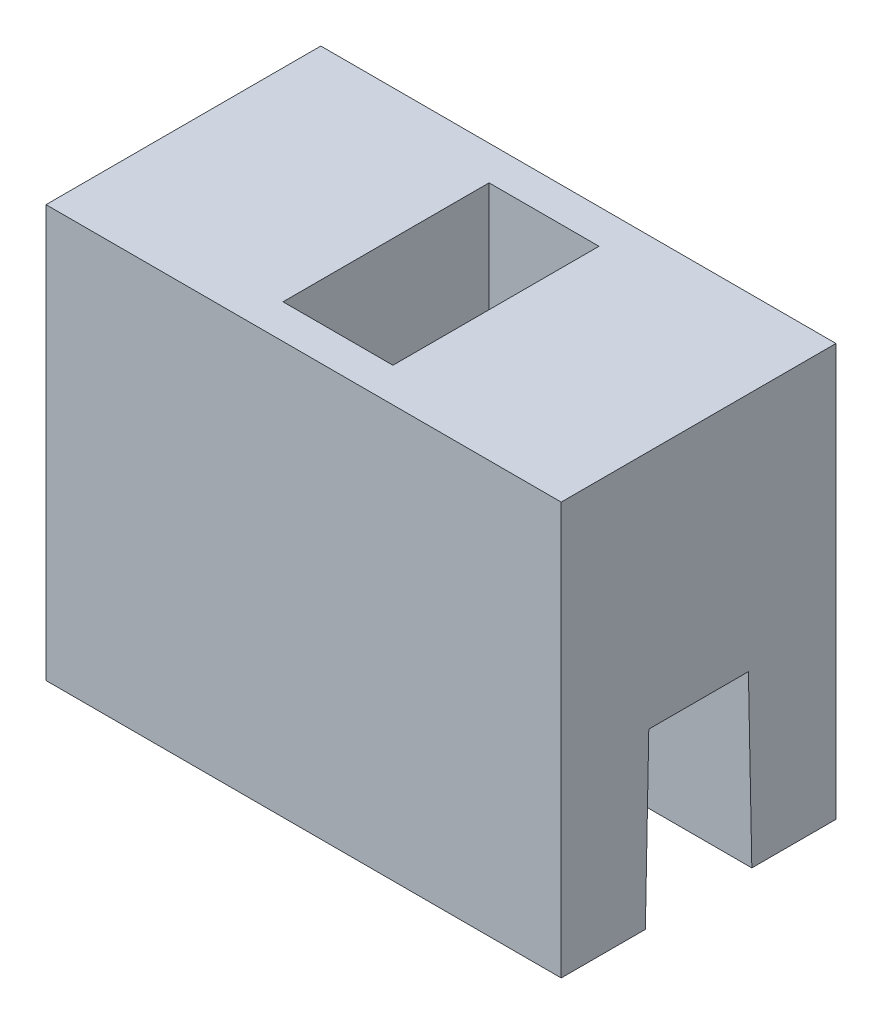
ISO-10303-21;
HEADER;
FILE_DESCRIPTION(('STEP AP214'),'2;1');
FILE_NAME('part.step','',(''),(''),'','','');
FILE_SCHEMA(('AUTOMOTIVE_DESIGN { 1 0 10303 214 1 1 1 1 }'));
ENDSEC;
DATA;
#1=APPLICATION_CONTEXT('core data for automotive mechanical design processes');
#2=APPLICATION_PROTOCOL_DEFINITION('international standard','automotive_design',2000,#1);
#3=PRODUCT_CONTEXT('',#1,'mechanical');
#4=PRODUCT('Part','Part','',(#3));
#5=PRODUCT_RELATED_PRODUCT_CATEGORY('part','',(#4));
#6=PRODUCT_DEFINITION_FORMATION('','',#4);
#7=PRODUCT_DEFINITION_CONTEXT('part definition',#1,'design');
#8=PRODUCT_DEFINITION('design','',#6,#7);
#9=PRODUCT_DEFINITION_SHAPE('','',#8);
#10=(LENGTH_UNIT() NAMED_UNIT(*) SI_UNIT(.MILLI.,.METRE.));
#11=(NAMED_UNIT(*) PLANE_ANGLE_UNIT() SI_UNIT($,.RADIAN.));
#12=(NAMED_UNIT(*) SI_UNIT($,.STERADIAN.) SOLID_ANGLE_UNIT());
#13=UNCERTAINTY_MEASURE_WITH_UNIT(LENGTH_MEASURE(1.E-05),#10,'distance_accuracy_value','');
#14=(GEOMETRIC_REPRESENTATION_CONTEXT(3) GLOBAL_UNCERTAINTY_ASSIGNED_CONTEXT((#13)) GLOBAL_UNIT_ASSIGNED_CONTEXT((#10,
#11,#12)) REPRESENTATION_CONTEXT('',''));
#15=CARTESIAN_POINT('',(0.,0.,0.));
#16=DIRECTION('',(0.,0.,1.));
#17=DIRECTION('',(1.,0.,0.));
#18=AXIS2_PLACEMENT_3D('',#15,#16,#17);
#19=CARTESIAN_POINT('',(7.5,0.,4.));
#20=DIRECTION('',(0.,1.,0.));
#21=DIRECTION('',(0.,0.,1.));
#22=AXIS2_PLACEMENT_3D('',#19,#20,#21);
#23=PLANE('',#22);
#24=DIRECTION('',(0.,0.,-1.));
#25=VECTOR('',#24,1.);
#26=CARTESIAN_POINT('',(-7.5,0.,4.));
#27=LINE('',#26,#25);
#28=CARTESIAN_POINT('',(-7.5,0.,4.));
#29=VERTEX_POINT('',#28);
#30=CARTESIAN_POINT('',(-7.5,0.,1.55));
#31=VERTEX_POINT('',#30);
#32=EDGE_CURVE('E163',#29,#31,#27,.T.);
#33=ORIENTED_EDGE('',*,*,#32,.T.);
#34=DIRECTION('',(-1.,0.,0.));
#35=VECTOR('',#34,1.);
#36=CARTESIAN_POINT('',(7.5,0.,1.55));
#37=LINE('',#36,#35);
#38=CARTESIAN_POINT('',(7.5,0.,1.55));
#39=VERTEX_POINT('',#38);
#40=EDGE_CURVE('E221',#39,#31,#37,.T.);
#41=ORIENTED_EDGE('',*,*,#40,.F.);
#42=DIRECTION('',(0.,0.,-1.));
#43=VECTOR('',#42,1.);
#44=CARTESIAN_POINT('',(7.5,0.,4.));
#45=LINE('',#44,#43);
#46=CARTESIAN_POINT('',(7.5,0.,4.));
#47=VERTEX_POINT('',#46);
#48=EDGE_CURVE('E167',#47,#39,#45,.T.);
#49=ORIENTED_EDGE('',*,*,#48,.F.);
#50=DIRECTION('',(-1.,0.,0.));
#51=VECTOR('',#50,1.);
#52=CARTESIAN_POINT('',(7.5,0.,4.));
#53=LINE('',#52,#51);
#54=EDGE_CURVE('E185',#47,#29,#53,.T.);
#55=ORIENTED_EDGE('',*,*,#54,.T.);
#56=EDGE_LOOP('',(#33,#41,#49,#55));
#57=FACE_BOUND('',#56,.T.);
#58=ADVANCED_FACE('F35',(#57),#23,.F.);
#59=CARTESIAN_POINT('',(7.5,0.,1.55));
#60=DIRECTION('',(0.,0.0199960011996003,0.999800059980007));
#61=DIRECTION('',(0.,-0.999800059980007,0.0199960011996003));
#62=AXIS2_PLACEMENT_3D('',#59,#60,#61);
#63=PLANE('',#62);
#64=DIRECTION('',(0.,0.999800059980007,-0.0199960011996003));
#65=VECTOR('',#64,1.);
#66=CARTESIAN_POINT('',(-7.5,0.,1.55));
#67=LINE('',#66,#65);
#68=CARTESIAN_POINT('',(-7.5,5.,1.45));
#69=VERTEX_POINT('',#68);
#70=EDGE_CURVE('E188',#31,#69,#67,.T.);
#71=ORIENTED_EDGE('',*,*,#70,.T.);
#72=DIRECTION('',(-1.,0.,0.));
#73=VECTOR('',#72,1.);
#74=CARTESIAN_POINT('',(7.5,5.,1.45));
#75=LINE('',#74,#73);
#76=CARTESIAN_POINT('',(7.5,5.,1.45));
#77=VERTEX_POINT('',#76);
#78=EDGE_CURVE('E218',#77,#69,#75,.T.);
#79=ORIENTED_EDGE('',*,*,#78,.F.);
#80=DIRECTION('',(0.,0.999800059980007,-0.0199960011996003));
#81=VECTOR('',#80,1.);
#82=CARTESIAN_POINT('',(7.5,0.,1.55));
#83=LINE('',#82,#81);
#84=EDGE_CURVE('E170',#39,#77,#83,.T.);
#85=ORIENTED_EDGE('',*,*,#84,.F.);
#86=ORIENTED_EDGE('',*,*,#40,.T.);
#87=EDGE_LOOP('',(#71,#79,#85,#86));
#88=FACE_BOUND('',#87,.T.);
#89=ADVANCED_FACE('F259',(#88),#63,.F.);
#90=CARTESIAN_POINT('',(7.5,5.,1.45));
#91=DIRECTION('',(0.,1.,0.));
#92=DIRECTION('',(0.,0.,1.));
#93=AXIS2_PLACEMENT_3D('',#90,#91,#92);
#94=PLANE('',#93);
#95=DIRECTION('',(0.,0.,-1.));
#96=VECTOR('',#95,1.);
#97=CARTESIAN_POINT('',(-7.5,5.,1.45));
#98=LINE('',#97,#96);
#99=CARTESIAN_POINT('',(-7.5,5.,-1.45));
#100=VERTEX_POINT('',#99);
#101=EDGE_CURVE('E190',#69,#100,#98,.T.);
#102=ORIENTED_EDGE('',*,*,#101,.T.);
#103=DIRECTION('',(-1.,0.,0.));
#104=VECTOR('',#103,1.);
#105=CARTESIAN_POINT('',(7.5,5.,-1.45));
#106=LINE('',#105,#104);
#107=CARTESIAN_POINT('',(7.5,5.,-1.45));
#108=VERTEX_POINT('',#107);
#109=EDGE_CURVE('E215',#108,#100,#106,.T.);
#110=ORIENTED_EDGE('',*,*,#109,.F.);
#111=DIRECTION('',(0.,0.,-1.));
#112=VECTOR('',#111,1.);
#113=CARTESIAN_POINT('',(7.5,5.,1.45));
#114=LINE('',#113,#112);
#115=EDGE_CURVE('E173',#77,#108,#114,.T.);
#116=ORIENTED_EDGE('',*,*,#115,.F.);
#117=ORIENTED_EDGE('',*,*,#78,.T.);
#118=EDGE_LOOP('',(#102,#110,#116,#117));
#119=FACE_BOUND('',#118,.T.);
#120=ADVANCED_FACE('F265',(#119),#94,.F.);
#121=CARTESIAN_POINT('',(7.5,5.,-1.45));
#122=DIRECTION('',(0.,0.0199960011996002,-0.999800059980007));
#123=DIRECTION('',(0.,0.999800059980007,0.0199960011996002));
#124=AXIS2_PLACEMENT_3D('',#121,#122,#123);
#125=PLANE('',#124);
#126=DIRECTION('',(0.,-0.999800059980007,-0.0199960011996002));
#127=VECTOR('',#126,1.);
#128=CARTESIAN_POINT('',(-7.5,5.,-1.45));
#129=LINE('',#128,#127);
#130=CARTESIAN_POINT('',(-7.5,0.,-1.55));
#131=VERTEX_POINT('',#130);
#132=EDGE_CURVE('E192',#100,#131,#129,.T.);
#133=ORIENTED_EDGE('',*,*,#132,.T.);
#134=DIRECTION('',(-1.,0.,0.));
#135=VECTOR('',#134,1.);
#136=CARTESIAN_POINT('',(7.5,0.,-1.55));
#137=LINE('',#136,#135);
#138=CARTESIAN_POINT('',(7.5,0.,-1.55));
#139=VERTEX_POINT('',#138);
#140=EDGE_CURVE('E212',#139,#131,#137,.T.);
#141=ORIENTED_EDGE('',*,*,#140,.F.);
#142=DIRECTION('',(0.,-0.999800059980007,-0.0199960011996002));
#143=VECTOR('',#142,1.);
#144=CARTESIAN_POINT('',(7.5,5.,-1.45));
#145=LINE('',#144,#143);
#146=EDGE_CURVE('E175',#108,#139,#145,.T.);
#147=ORIENTED_EDGE('',*,*,#146,.F.);
#148=ORIENTED_EDGE('',*,*,#109,.T.);
#149=EDGE_LOOP('',(#133,#141,#147,#148));
#150=FACE_BOUND('',#149,.T.);
#151=ADVANCED_FACE('F271',(#150),#125,.F.);
#152=CARTESIAN_POINT('',(7.5,0.,-1.55));
#153=DIRECTION('',(0.,1.,0.));
#154=DIRECTION('',(0.,0.,1.));
#155=AXIS2_PLACEMENT_3D('',#152,#153,#154);
#156=PLANE('',#155);
#157=DIRECTION('',(0.,0.,-1.));
#158=VECTOR('',#157,1.);
#159=CARTESIAN_POINT('',(-7.5,0.,-1.55));
#160=LINE('',#159,#158);
#161=CARTESIAN_POINT('',(-7.5,0.,-4.));
#162=VERTEX_POINT('',#161);
#163=EDGE_CURVE('E194',#131,#162,#160,.T.);
#164=ORIENTED_EDGE('',*,*,#163,.T.);
#165=DIRECTION('',(-1.,0.,0.));
#166=VECTOR('',#165,1.);
#167=CARTESIAN_POINT('',(7.5,0.,-4.));
#168=LINE('',#167,#166);
#169=CARTESIAN_POINT('',(7.5,0.,-4.));
#170=VERTEX_POINT('',#169);
#171=EDGE_CURVE('E209',#170,#162,#168,.T.);
#172=ORIENTED_EDGE('',*,*,#171,.F.);
#173=DIRECTION('',(0.,0.,-1.));
#174=VECTOR('',#173,1.);
#175=CARTESIAN_POINT('',(7.5,0.,-1.55));
#176=LINE('',#175,#174);
#177=EDGE_CURVE('E177',#139,#170,#176,.T.);
#178=ORIENTED_EDGE('',*,*,#177,.F.);
#179=ORIENTED_EDGE('',*,*,#140,.T.);
#180=EDGE_LOOP('',(#164,#172,#178,#179));
#181=FACE_BOUND('',#180,.T.);
#182=ADVANCED_FACE('F275',(#181),#156,.F.);
#183=CARTESIAN_POINT('',(7.5,0.,-4.));
#184=DIRECTION('',(0.,0.,1.));
#185=DIRECTION('',(1.,0.,0.));
#186=AXIS2_PLACEMENT_3D('',#183,#184,#185);
#187=PLANE('',#186);
#188=DIRECTION('',(0.,1.,0.));
#189=VECTOR('',#188,1.);
#190=CARTESIAN_POINT('',(-7.5,0.,-4.));
#191=LINE('',#190,#189);
#192=CARTESIAN_POINT('',(-7.5,12.,-4.));
#193=VERTEX_POINT('',#192);
#194=EDGE_CURVE('E196',#162,#193,#191,.T.);
#195=ORIENTED_EDGE('',*,*,#194,.T.);
#196=DIRECTION('',(-1.,0.,0.));
#197=VECTOR('',#196,1.);
#198=CARTESIAN_POINT('',(7.5,12.,-4.));
#199=LINE('',#198,#197);
#200=CARTESIAN_POINT('',(7.5,12.,-4.));
#201=VERTEX_POINT('',#200);
#202=EDGE_CURVE('E206',#201,#193,#199,.T.);
#203=ORIENTED_EDGE('',*,*,#202,.F.);
#204=DIRECTION('',(0.,1.,0.));
#205=VECTOR('',#204,1.);
#206=CARTESIAN_POINT('',(7.5,0.,-4.));
#207=LINE('',#206,#205);
#208=EDGE_CURVE('E179',#170,#201,#207,.T.);
#209=ORIENTED_EDGE('',*,*,#208,.F.);
#210=ORIENTED_EDGE('',*,*,#171,.T.);
#211=EDGE_LOOP('',(#195,#203,#209,#210));
#212=FACE_BOUND('',#211,.T.);
#213=ADVANCED_FACE('F279',(#212),#187,.F.);
#214=CARTESIAN_POINT('',(7.5,12.,-4.));
#215=DIRECTION('',(0.,-1.,0.));
#216=DIRECTION('',(0.,0.,-1.));
#217=AXIS2_PLACEMENT_3D('',#214,#215,#216);
#218=PLANE('',#217);
#219=DIRECTION('',(-1.,0.,0.));
#220=VECTOR('',#219,1.);
#221=CARTESIAN_POINT('',(1.6,12.,-3.));
#222=LINE('',#221,#220);
#223=CARTESIAN_POINT('',(1.6,12.,-3.));
#224=VERTEX_POINT('',#223);
#225=CARTESIAN_POINT('',(-1.6,12.,-3.));
#226=VERTEX_POINT('',#225);
#227=EDGE_CURVE('E145',#224,#226,#222,.T.);
#228=ORIENTED_EDGE('',*,*,#227,.F.);
#229=DIRECTION('',(0.,0.,-1.));
#230=VECTOR('',#229,1.);
#231=CARTESIAN_POINT('',(1.6,12.,-3.));
#232=LINE('',#231,#230);
#233=CARTESIAN_POINT('',(1.6,12.,3.));
#234=VERTEX_POINT('',#233);
#235=EDGE_CURVE('E150',#234,#224,#232,.T.);
#236=ORIENTED_EDGE('',*,*,#235,.F.);
#237=DIRECTION('',(1.,0.,0.));
#238=VECTOR('',#237,1.);
#239=CARTESIAN_POINT('',(1.6,12.,3.));
#240=LINE('',#239,#238);
#241=CARTESIAN_POINT('',(-1.6,12.,3.));
#242=VERTEX_POINT('',#241);
#243=EDGE_CURVE('E155',#242,#234,#240,.T.);
#244=ORIENTED_EDGE('',*,*,#243,.F.);
#245=DIRECTION('',(0.,0.,1.));
#246=VECTOR('',#245,1.);
#247=CARTESIAN_POINT('',(-1.6,12.,-3.));
#248=LINE('',#247,#246);
#249=EDGE_CURVE('E138',#226,#242,#248,.T.);
#250=ORIENTED_EDGE('',*,*,#249,.F.);
#251=EDGE_LOOP('',(#228,#236,#244,#250));
#252=FACE_BOUND('',#251,.T.);
#253=DIRECTION('',(0.,0.,1.));
#254=VECTOR('',#253,1.);
#255=CARTESIAN_POINT('',(-7.5,12.,-4.));
#256=LINE('',#255,#254);
#257=CARTESIAN_POINT('',(-7.5,12.,4.));
#258=VERTEX_POINT('',#257);
#259=EDGE_CURVE('E198',#193,#258,#256,.T.);
#260=ORIENTED_EDGE('',*,*,#259,.T.);
#261=DIRECTION('',(-1.,0.,0.));
#262=VECTOR('',#261,1.);
#263=CARTESIAN_POINT('',(7.5,12.,4.));
#264=LINE('',#263,#262);
#265=CARTESIAN_POINT('',(7.5,12.,4.));
#266=VERTEX_POINT('',#265);
#267=EDGE_CURVE('E203',#266,#258,#264,.T.);
#268=ORIENTED_EDGE('',*,*,#267,.F.);
#269=DIRECTION('',(0.,0.,1.));
#270=VECTOR('',#269,1.);
#271=CARTESIAN_POINT('',(7.5,12.,-4.));
#272=LINE('',#271,#270);
#273=EDGE_CURVE('E181',#201,#266,#272,.T.);
#274=ORIENTED_EDGE('',*,*,#273,.F.);
#275=ORIENTED_EDGE('',*,*,#202,.T.);
#276=EDGE_LOOP('',(#260,#268,#274,#275));
#277=FACE_BOUND('',#276,.T.);
#278=ADVANCED_FACE('F152',(#252,#277),#218,.F.);
#279=CARTESIAN_POINT('',(7.5,12.,4.));
#280=DIRECTION('',(0.,0.,-1.));
#281=DIRECTION('',(-1.,0.,0.));
#282=AXIS2_PLACEMENT_3D('',#279,#280,#281);
#283=PLANE('',#282);
#284=DIRECTION('',(0.,-1.,0.));
#285=VECTOR('',#284,1.);
#286=CARTESIAN_POINT('',(-7.5,12.,4.));
#287=LINE('',#286,#285);
#288=EDGE_CURVE('E171',#258,#29,#287,.T.);
#289=ORIENTED_EDGE('',*,*,#288,.T.);
#290=ORIENTED_EDGE('',*,*,#54,.F.);
#291=DIRECTION('',(0.,-1.,0.));
#292=VECTOR('',#291,1.);
#293=CARTESIAN_POINT('',(7.5,12.,4.));
#294=LINE('',#293,#292);
#295=EDGE_CURVE('E183',#266,#47,#294,.T.);
#296=ORIENTED_EDGE('',*,*,#295,.F.);
#297=ORIENTED_EDGE('',*,*,#267,.T.);
#298=EDGE_LOOP('',(#289,#290,#296,#297));
#299=FACE_BOUND('',#298,.T.);
#300=ADVANCED_FACE('F286',(#299),#283,.F.);
#301=CARTESIAN_POINT('',(7.5,0.,0.));
#302=DIRECTION('',(1.,0.,0.));
#303=DIRECTION('',(0.,0.,-1.));
#304=AXIS2_PLACEMENT_3D('',#301,#302,#303);
#305=PLANE('',#304);
#306=ORIENTED_EDGE('',*,*,#48,.T.);
#307=ORIENTED_EDGE('',*,*,#84,.T.);
#308=ORIENTED_EDGE('',*,*,#115,.T.);
#309=ORIENTED_EDGE('',*,*,#146,.T.);
#310=ORIENTED_EDGE('',*,*,#177,.T.);
#311=ORIENTED_EDGE('',*,*,#208,.T.);
#312=ORIENTED_EDGE('',*,*,#273,.T.);
#313=ORIENTED_EDGE('',*,*,#295,.T.);
#314=EDGE_LOOP('',(#306,#307,#308,#309,#310,#311,#312,#313));
#315=FACE_BOUND('',#314,.T.);
#316=ADVANCED_FACE('F289',(#315),#305,.T.);
#317=CARTESIAN_POINT('',(-7.5,0.,0.));
#318=DIRECTION('',(1.,0.,0.));
#319=DIRECTION('',(0.,0.,-1.));
#320=AXIS2_PLACEMENT_3D('',#317,#318,#319);
#321=PLANE('',#320);
#322=ORIENTED_EDGE('',*,*,#32,.F.);
#323=ORIENTED_EDGE('',*,*,#288,.F.);
#324=ORIENTED_EDGE('',*,*,#259,.F.);
#325=ORIENTED_EDGE('',*,*,#194,.F.);
#326=ORIENTED_EDGE('',*,*,#163,.F.);
#327=ORIENTED_EDGE('',*,*,#132,.F.);
#328=ORIENTED_EDGE('',*,*,#101,.F.);
#329=ORIENTED_EDGE('',*,*,#70,.F.);
#330=EDGE_LOOP('',(#322,#323,#324,#325,#326,#327,#328,#329));
#331=FACE_BOUND('',#330,.T.);
#332=ADVANCED_FACE('F291',(#331),#321,.F.);
#333=CARTESIAN_POINT('',(1.6,7.,-3.));
#334=DIRECTION('',(1.,0.,0.));
#335=DIRECTION('',(0.,0.,-1.));
#336=AXIS2_PLACEMENT_3D('',#333,#334,#335);
#337=PLANE('',#336);
#338=DIRECTION('',(0.,1.,0.));
#339=VECTOR('',#338,1.);
#340=CARTESIAN_POINT('',(1.6,7.,-3.));
#341=LINE('',#340,#339);
#342=CARTESIAN_POINT('',(1.6,8.5,-3.));
#343=VERTEX_POINT('',#342);
#344=EDGE_CURVE('E142',#343,#224,#341,.T.);
#345=ORIENTED_EDGE('',*,*,#344,.F.);
#346=DIRECTION('',(0.,0.,-1.));
#347=VECTOR('',#346,1.);
#348=CARTESIAN_POINT('',(1.6,8.5,3.));
#349=LINE('',#348,#347);
#350=CARTESIAN_POINT('',(1.6,8.5,3.));
#351=VERTEX_POINT('',#350);
#352=EDGE_CURVE('E11',#343,#351,#349,.F.);
#353=ORIENTED_EDGE('',*,*,#352,.T.);
#354=DIRECTION('',(0.,1.,0.));
#355=VECTOR('',#354,1.);
#356=CARTESIAN_POINT('',(1.6,7.,3.));
#357=LINE('',#356,#355);
#358=EDGE_CURVE('E161',#351,#234,#357,.T.);
#359=ORIENTED_EDGE('',*,*,#358,.T.);
#360=ORIENTED_EDGE('',*,*,#235,.T.);
#361=EDGE_LOOP('',(#345,#353,#359,#360));
#362=FACE_BOUND('',#361,.T.);
#363=ADVANCED_FACE('F251',(#362),#337,.F.);
#364=CARTESIAN_POINT('',(1.6,7.,3.));
#365=DIRECTION('',(0.,0.,1.));
#366=DIRECTION('',(1.,0.,0.));
#367=AXIS2_PLACEMENT_3D('',#364,#365,#366);
#368=PLANE('',#367);
#369=DIRECTION('',(1.,0.,0.));
#370=VECTOR('',#369,1.);
#371=CARTESIAN_POINT('',(1.6,7.,3.));
#372=LINE('',#371,#370);
#373=CARTESIAN_POINT('',(-0.1,7.,3.));
#374=VERTEX_POINT('',#373);
#375=CARTESIAN_POINT('',(0.1,7.,3.));
#376=VERTEX_POINT('',#375);
#377=EDGE_CURVE('E166',#374,#376,#372,.T.);
#378=ORIENTED_EDGE('',*,*,#377,.F.);
#379=CARTESIAN_POINT('',(-0.1,8.5,3.));
#380=DIRECTION('',(0.,0.,1.));
#381=DIRECTION('',(1.,0.,0.));
#382=AXIS2_PLACEMENT_3D('',#379,#380,#381);
#383=CIRCLE('',#382,1.5);
#384=CARTESIAN_POINT('',(-1.6,8.5,3.));
#385=VERTEX_POINT('',#384);
#386=EDGE_CURVE('E232',#374,#385,#383,.F.);
#387=ORIENTED_EDGE('',*,*,#386,.T.);
#388=DIRECTION('',(0.,1.,0.));
#389=VECTOR('',#388,1.);
#390=CARTESIAN_POINT('',(-1.6,7.,3.));
#391=LINE('',#390,#389);
#392=EDGE_CURVE('E141',#385,#242,#391,.T.);
#393=ORIENTED_EDGE('',*,*,#392,.T.);
#394=ORIENTED_EDGE('',*,*,#243,.T.);
#395=ORIENTED_EDGE('',*,*,#358,.F.);
#396=CARTESIAN_POINT('',(0.1,8.5,3.));
#397=DIRECTION('',(0.,0.,1.));
#398=DIRECTION('',(1.,0.,0.));
#399=AXIS2_PLACEMENT_3D('',#396,#397,#398);
#400=CIRCLE('',#399,1.5);
#401=EDGE_CURVE('E230',#351,#376,#400,.F.);
#402=ORIENTED_EDGE('',*,*,#401,.T.);
#403=EDGE_LOOP('',(#378,#387,#393,#394,#395,#402));
#404=FACE_BOUND('',#403,.T.);
#405=ADVANCED_FACE('F246',(#404),#368,.F.);
#406=CARTESIAN_POINT('',(-1.6,7.,-3.));
#407=DIRECTION('',(-1.,0.,0.));
#408=DIRECTION('',(0.,0.,1.));
#409=AXIS2_PLACEMENT_3D('',#406,#407,#408);
#410=PLANE('',#409);
#411=ORIENTED_EDGE('',*,*,#392,.F.);
#412=DIRECTION('',(0.,0.,1.));
#413=VECTOR('',#412,1.);
#414=CARTESIAN_POINT('',(-1.6,8.5,-3.));
#415=LINE('',#414,#413);
#416=CARTESIAN_POINT('',(-1.6,8.5,-3.));
#417=VERTEX_POINT('',#416);
#418=EDGE_CURVE('E58',#385,#417,#415,.F.);
#419=ORIENTED_EDGE('',*,*,#418,.T.);
#420=DIRECTION('',(0.,1.,0.));
#421=VECTOR('',#420,1.);
#422=CARTESIAN_POINT('',(-1.6,7.,-3.));
#423=LINE('',#422,#421);
#424=EDGE_CURVE('E134',#417,#226,#423,.T.);
#425=ORIENTED_EDGE('',*,*,#424,.T.);
#426=ORIENTED_EDGE('',*,*,#249,.T.);
#427=EDGE_LOOP('',(#411,#419,#425,#426));
#428=FACE_BOUND('',#427,.T.);
#429=ADVANCED_FACE('F136',(#428),#410,.F.);
#430=CARTESIAN_POINT('',(1.6,7.,-3.));
#431=DIRECTION('',(0.,0.,-1.));
#432=DIRECTION('',(-1.,0.,0.));
#433=AXIS2_PLACEMENT_3D('',#430,#431,#432);
#434=PLANE('',#433);
#435=ORIENTED_EDGE('',*,*,#424,.F.);
#436=CARTESIAN_POINT('',(-0.1,8.5,-3.));
#437=DIRECTION('',(0.,0.,-1.));
#438=DIRECTION('',(-1.,0.,0.));
#439=AXIS2_PLACEMENT_3D('',#436,#437,#438);
#440=CIRCLE('',#439,1.5);
#441=CARTESIAN_POINT('',(-0.1,7.,-3.));
#442=VERTEX_POINT('',#441);
#443=EDGE_CURVE('E43',#417,#442,#440,.F.);
#444=ORIENTED_EDGE('',*,*,#443,.T.);
#445=DIRECTION('',(-1.,0.,0.));
#446=VECTOR('',#445,1.);
#447=CARTESIAN_POINT('',(1.6,7.,-3.));
#448=LINE('',#447,#446);
#449=CARTESIAN_POINT('',(0.1,7.,-3.));
#450=VERTEX_POINT('',#449);
#451=EDGE_CURVE('E157',#450,#442,#448,.T.);
#452=ORIENTED_EDGE('',*,*,#451,.F.);
#453=CARTESIAN_POINT('',(0.1,8.5,-3.));
#454=DIRECTION('',(0.,0.,-1.));
#455=DIRECTION('',(-1.,0.,0.));
#456=AXIS2_PLACEMENT_3D('',#453,#454,#455);
#457=CIRCLE('',#456,1.5);
#458=EDGE_CURVE('E50',#450,#343,#457,.F.);
#459=ORIENTED_EDGE('',*,*,#458,.T.);
#460=ORIENTED_EDGE('',*,*,#344,.T.);
#461=ORIENTED_EDGE('',*,*,#227,.T.);
#462=EDGE_LOOP('',(#435,#444,#452,#459,#460,#461));
#463=FACE_BOUND('',#462,.T.);
#464=ADVANCED_FACE('F146',(#463),#434,.F.);
#465=CARTESIAN_POINT('',(0.,7.,0.));
#466=DIRECTION('',(0.,-1.,0.));
#467=DIRECTION('',(0.,0.,-1.));
#468=AXIS2_PLACEMENT_3D('',#465,#466,#467);
#469=PLANE('',#468);
#470=ORIENTED_EDGE('',*,*,#451,.T.);
#471=DIRECTION('',(0.,0.,1.));
#472=VECTOR('',#471,1.);
#473=CARTESIAN_POINT('',(-0.1,7.,3.));
#474=LINE('',#473,#472);
#475=EDGE_CURVE('E227',#442,#374,#474,.T.);
#476=ORIENTED_EDGE('',*,*,#475,.T.);
#477=ORIENTED_EDGE('',*,*,#377,.T.);
#478=DIRECTION('',(0.,0.,-1.));
#479=VECTOR('',#478,1.);
#480=CARTESIAN_POINT('',(0.1,7.,-3.));
#481=LINE('',#480,#479);
#482=EDGE_CURVE('E224',#376,#450,#481,.T.);
#483=ORIENTED_EDGE('',*,*,#482,.T.);
#484=EDGE_LOOP('',(#470,#476,#477,#483));
#485=FACE_BOUND('',#484,.T.);
#486=ADVANCED_FACE('F239',(#485),#469,.F.);
#487=CARTESIAN_POINT('',(-0.1,8.5,0.));
#488=DIRECTION('',(0.,0.,-1.));
#489=DIRECTION('',(-1.,0.,0.));
#490=AXIS2_PLACEMENT_3D('',#487,#488,#489);
#491=CYLINDRICAL_SURFACE('',#490,1.5);
#492=ORIENTED_EDGE('',*,*,#443,.F.);
#493=ORIENTED_EDGE('',*,*,#418,.F.);
#494=ORIENTED_EDGE('',*,*,#386,.F.);
#495=ORIENTED_EDGE('',*,*,#475,.F.);
#496=EDGE_LOOP('',(#492,#493,#494,#495));
#497=FACE_BOUND('',#496,.T.);
#498=ADVANCED_FACE('F244',(#497),#491,.F.);
#499=CARTESIAN_POINT('',(0.1,8.5,0.));
#500=DIRECTION('',(0.,0.,1.));
#501=DIRECTION('',(1.,0.,0.));
#502=AXIS2_PLACEMENT_3D('',#499,#500,#501);
#503=CYLINDRICAL_SURFACE('',#502,1.5);
#504=ORIENTED_EDGE('',*,*,#401,.F.);
#505=ORIENTED_EDGE('',*,*,#352,.F.);
#506=ORIENTED_EDGE('',*,*,#458,.F.);
#507=ORIENTED_EDGE('',*,*,#482,.F.);
#508=EDGE_LOOP('',(#504,#505,#506,#507));
#509=FACE_BOUND('',#508,.T.);
#510=ADVANCED_FACE('F37',(#509),#503,.F.);
#511=CLOSED_SHELL('',(#58,#89,#120,#151,#182,#213,#278,#300,#316,#332,#363,#405,#429,#464,#486,
#498,#510));
#512=MANIFOLD_SOLID_BREP('B2',#511);
#513=ADVANCED_BREP_SHAPE_REPRESENTATION('',(#18,#512),#14);
#514=SHAPE_DEFINITION_REPRESENTATION(#9,#513);
ENDSEC;
END-ISO-10303-21;
